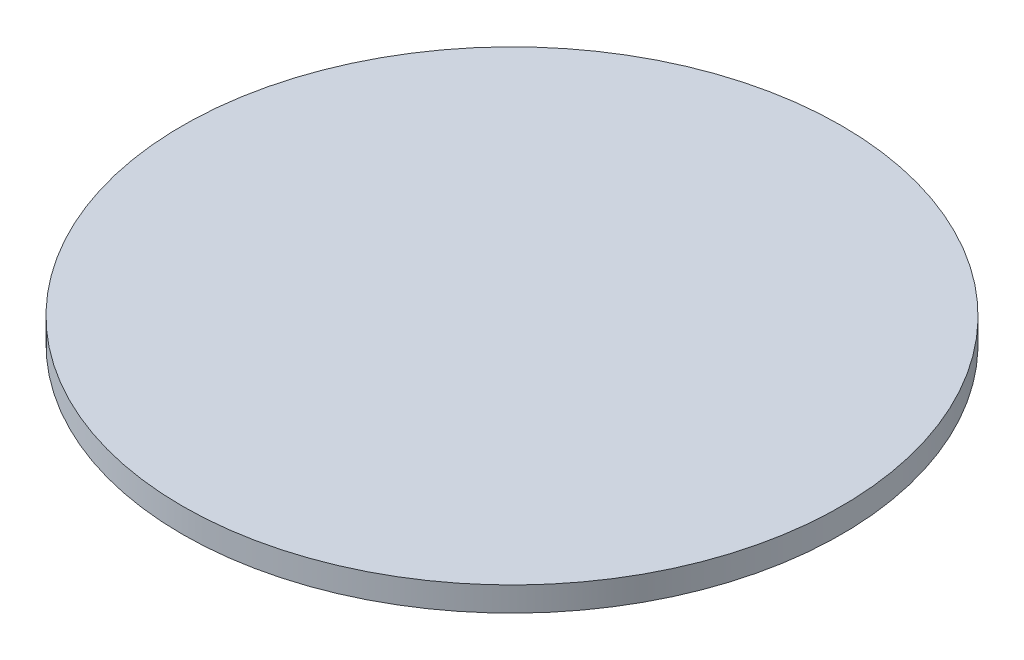
ISO-10303-21;
HEADER;
FILE_DESCRIPTION(('STEP AP214'),'2;1');
FILE_NAME('part.step','',(''),(''),'','','');
FILE_SCHEMA(('AUTOMOTIVE_DESIGN { 1 0 10303 214 1 1 1 1 }'));
ENDSEC;
DATA;
#1=APPLICATION_CONTEXT('core data for automotive mechanical design processes');
#2=APPLICATION_PROTOCOL_DEFINITION('international standard','automotive_design',2000,#1);
#3=PRODUCT_CONTEXT('',#1,'mechanical');
#4=PRODUCT('Part','Part','',(#3));
#5=PRODUCT_RELATED_PRODUCT_CATEGORY('part','',(#4));
#6=PRODUCT_DEFINITION_FORMATION('','',#4);
#7=PRODUCT_DEFINITION_CONTEXT('part definition',#1,'design');
#8=PRODUCT_DEFINITION('design','',#6,#7);
#9=PRODUCT_DEFINITION_SHAPE('','',#8);
#10=(LENGTH_UNIT() NAMED_UNIT(*) SI_UNIT(.MILLI.,.METRE.));
#11=(NAMED_UNIT(*) PLANE_ANGLE_UNIT() SI_UNIT($,.RADIAN.));
#12=(NAMED_UNIT(*) SI_UNIT($,.STERADIAN.) SOLID_ANGLE_UNIT());
#13=UNCERTAINTY_MEASURE_WITH_UNIT(LENGTH_MEASURE(1.E-05),#10,'distance_accuracy_value','');
#14=(GEOMETRIC_REPRESENTATION_CONTEXT(3) GLOBAL_UNCERTAINTY_ASSIGNED_CONTEXT((#13)) GLOBAL_UNIT_ASSIGNED_CONTEXT((#10,
#11,#12)) REPRESENTATION_CONTEXT('',''));
#15=CARTESIAN_POINT('',(0.,0.,0.));
#16=DIRECTION('',(0.,0.,1.));
#17=DIRECTION('',(1.,0.,0.));
#18=AXIS2_PLACEMENT_3D('',#15,#16,#17);
#19=CARTESIAN_POINT('',(0.,1.,0.));
#20=DIRECTION('',(0.,-1.,0.));
#21=DIRECTION('',(0.,0.,-1.));
#22=AXIS2_PLACEMENT_3D('',#19,#20,#21);
#23=CYLINDRICAL_SURFACE('',#22,13.5);
#24=CARTESIAN_POINT('',(0.,1.,0.));
#25=DIRECTION('',(0.,1.,0.));
#26=DIRECTION('',(0.,0.,1.));
#27=AXIS2_PLACEMENT_3D('',#24,#25,#26);
#28=CIRCLE('',#27,13.5);
#29=CARTESIAN_POINT('',(0.,1.,13.5));
#30=VERTEX_POINT('',#29);
#31=EDGE_CURVE('E10',#30,#30,#28,.T.);
#32=ORIENTED_EDGE('',*,*,#31,.F.);
#33=EDGE_LOOP('',(#32));
#34=FACE_BOUND('',#33,.T.);
#35=CARTESIAN_POINT('',(0.,0.,0.));
#36=DIRECTION('',(0.,1.,0.));
#37=DIRECTION('',(0.,0.,1.));
#38=AXIS2_PLACEMENT_3D('',#35,#36,#37);
#39=CIRCLE('',#38,13.5);
#40=CARTESIAN_POINT('',(0.,0.,13.5));
#41=VERTEX_POINT('',#40);
#42=EDGE_CURVE('E33',#41,#41,#39,.T.);
#43=ORIENTED_EDGE('',*,*,#42,.T.);
#44=EDGE_LOOP('',(#43));
#45=FACE_BOUND('',#44,.T.);
#46=ADVANCED_FACE('F30',(#34,#45),#23,.T.);
#47=CARTESIAN_POINT('',(0.,1.,0.));
#48=DIRECTION('',(0.,1.,0.));
#49=DIRECTION('',(0.,0.,1.));
#50=AXIS2_PLACEMENT_3D('',#47,#48,#49);
#51=PLANE('',#50);
#52=ORIENTED_EDGE('',*,*,#31,.T.);
#53=EDGE_LOOP('',(#52));
#54=FACE_BOUND('',#53,.T.);
#55=ADVANCED_FACE('F45',(#54),#51,.T.);
#56=CARTESIAN_POINT('',(0.,0.,0.));
#57=DIRECTION('',(0.,1.,0.));
#58=DIRECTION('',(0.,0.,1.));
#59=AXIS2_PLACEMENT_3D('',#56,#57,#58);
#60=PLANE('',#59);
#61=ORIENTED_EDGE('',*,*,#42,.F.);
#62=EDGE_LOOP('',(#61));
#63=FACE_BOUND('',#62,.T.);
#64=ADVANCED_FACE('F43',(#63),#60,.F.);
#65=CLOSED_SHELL('',(#46,#55,#64));
#66=MANIFOLD_SOLID_BREP('B2',#65);
#67=ADVANCED_BREP_SHAPE_REPRESENTATION('',(#18,#66),#14);
#68=SHAPE_DEFINITION_REPRESENTATION(#9,#67);
ENDSEC;
END-ISO-10303-21;
